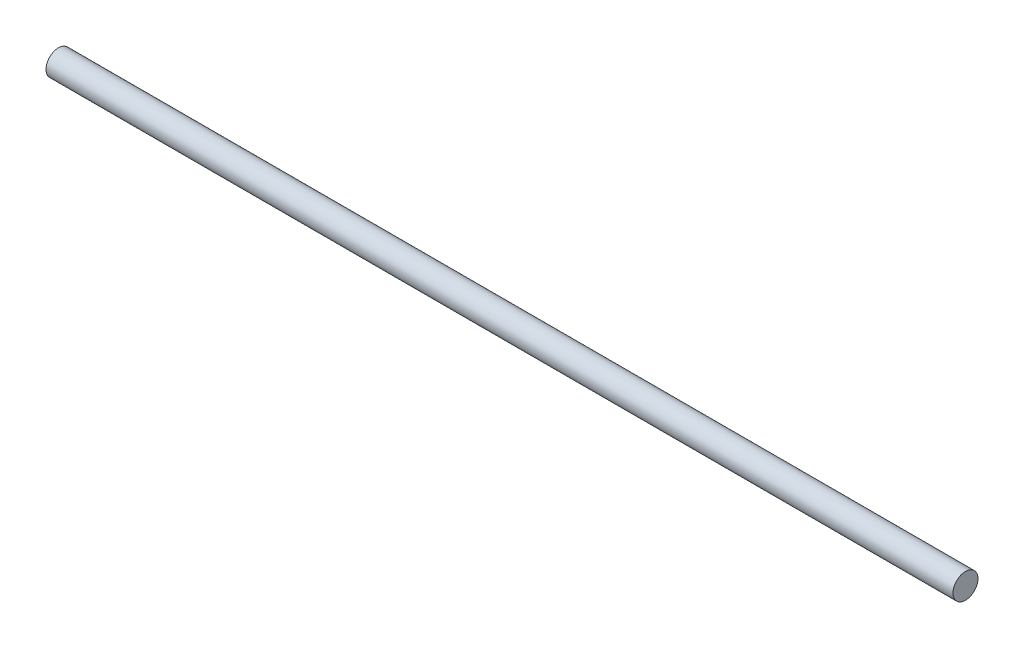
ISO-10303-21;
HEADER;
FILE_DESCRIPTION(('STEP AP214'),'2;1');
FILE_NAME('part.step','',(''),(''),'','','');
FILE_SCHEMA(('AUTOMOTIVE_DESIGN { 1 0 10303 214 1 1 1 1 }'));
ENDSEC;
DATA;
#1=APPLICATION_CONTEXT('core data for automotive mechanical design processes');
#2=APPLICATION_PROTOCOL_DEFINITION('international standard','automotive_design',2000,#1);
#3=PRODUCT_CONTEXT('',#1,'mechanical');
#4=PRODUCT('Part','Part','',(#3));
#5=PRODUCT_RELATED_PRODUCT_CATEGORY('part','',(#4));
#6=PRODUCT_DEFINITION_FORMATION('','',#4);
#7=PRODUCT_DEFINITION_CONTEXT('part definition',#1,'design');
#8=PRODUCT_DEFINITION('design','',#6,#7);
#9=PRODUCT_DEFINITION_SHAPE('','',#8);
#10=(LENGTH_UNIT() NAMED_UNIT(*) SI_UNIT(.MILLI.,.METRE.));
#11=(NAMED_UNIT(*) PLANE_ANGLE_UNIT() SI_UNIT($,.RADIAN.));
#12=(NAMED_UNIT(*) SI_UNIT($,.STERADIAN.) SOLID_ANGLE_UNIT());
#13=UNCERTAINTY_MEASURE_WITH_UNIT(LENGTH_MEASURE(1.E-05),#10,'distance_accuracy_value','');
#14=(GEOMETRIC_REPRESENTATION_CONTEXT(3) GLOBAL_UNCERTAINTY_ASSIGNED_CONTEXT((#13)) GLOBAL_UNIT_ASSIGNED_CONTEXT((#10,
#11,#12)) REPRESENTATION_CONTEXT('',''));
#15=CARTESIAN_POINT('',(0.,0.,0.));
#16=DIRECTION('',(0.,0.,1.));
#17=DIRECTION('',(1.,0.,0.));
#18=AXIS2_PLACEMENT_3D('',#15,#16,#17);
#19=CARTESIAN_POINT('',(290.,0.,0.));
#20=DIRECTION('',(-1.,0.,0.));
#21=DIRECTION('',(0.,0.,1.));
#22=AXIS2_PLACEMENT_3D('',#19,#20,#21);
#23=CYLINDRICAL_SURFACE('',#22,4.);
#24=CARTESIAN_POINT('',(290.,0.,0.));
#25=DIRECTION('',(1.,0.,0.));
#26=DIRECTION('',(0.,0.,-1.));
#27=AXIS2_PLACEMENT_3D('',#24,#25,#26);
#28=CIRCLE('',#27,4.);
#29=CARTESIAN_POINT('',(290.,0.,-4.));
#30=VERTEX_POINT('',#29);
#31=EDGE_CURVE('E10',#30,#30,#28,.T.);
#32=ORIENTED_EDGE('',*,*,#31,.F.);
#33=EDGE_LOOP('',(#32));
#34=FACE_BOUND('',#33,.T.);
#35=CARTESIAN_POINT('',(0.,0.,0.));
#36=DIRECTION('',(1.,0.,0.));
#37=DIRECTION('',(0.,0.,-1.));
#38=AXIS2_PLACEMENT_3D('',#35,#36,#37);
#39=CIRCLE('',#38,4.);
#40=CARTESIAN_POINT('',(0.,0.,-4.));
#41=VERTEX_POINT('',#40);
#42=EDGE_CURVE('E34',#41,#41,#39,.T.);
#43=ORIENTED_EDGE('',*,*,#42,.T.);
#44=EDGE_LOOP('',(#43));
#45=FACE_BOUND('',#44,.T.);
#46=ADVANCED_FACE('F31',(#34,#45),#23,.T.);
#47=CARTESIAN_POINT('',(290.,0.,0.));
#48=DIRECTION('',(1.,0.,0.));
#49=DIRECTION('',(0.,0.,-1.));
#50=AXIS2_PLACEMENT_3D('',#47,#48,#49);
#51=PLANE('',#50);
#52=ORIENTED_EDGE('',*,*,#31,.T.);
#53=EDGE_LOOP('',(#52));
#54=FACE_BOUND('',#53,.T.);
#55=ADVANCED_FACE('F46',(#54),#51,.T.);
#56=CARTESIAN_POINT('',(0.,0.,0.));
#57=DIRECTION('',(1.,0.,0.));
#58=DIRECTION('',(0.,0.,-1.));
#59=AXIS2_PLACEMENT_3D('',#56,#57,#58);
#60=PLANE('',#59);
#61=ORIENTED_EDGE('',*,*,#42,.F.);
#62=EDGE_LOOP('',(#61));
#63=FACE_BOUND('',#62,.T.);
#64=ADVANCED_FACE('F44',(#63),#60,.F.);
#65=CLOSED_SHELL('',(#46,#55,#64));
#66=MANIFOLD_SOLID_BREP('B2',#65);
#67=ADVANCED_BREP_SHAPE_REPRESENTATION('',(#18,#66),#14);
#68=SHAPE_DEFINITION_REPRESENTATION(#9,#67);
ENDSEC;
END-ISO-10303-21;
